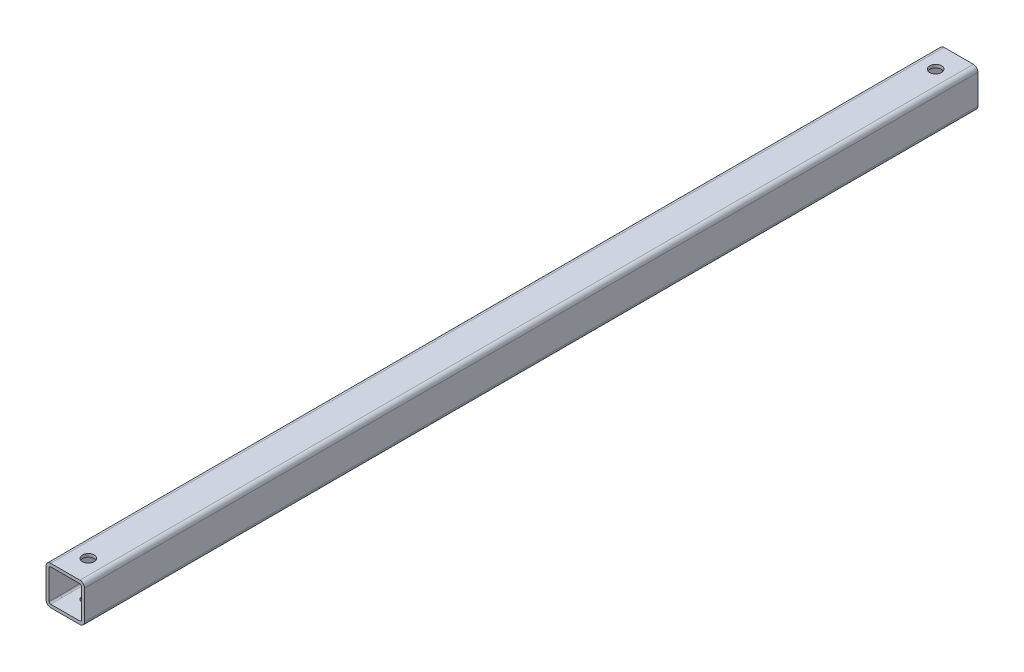
ISO-10303-21;
HEADER;
FILE_DESCRIPTION(('STEP AP214'),'2;1');
FILE_NAME('part.step','',(''),(''),'','','');
FILE_SCHEMA(('AUTOMOTIVE_DESIGN { 1 0 10303 214 1 1 1 1 }'));
ENDSEC;
DATA;
#1=APPLICATION_CONTEXT('core data for automotive mechanical design processes');
#2=APPLICATION_PROTOCOL_DEFINITION('international standard','automotive_design',2000,#1);
#3=PRODUCT_CONTEXT('',#1,'mechanical');
#4=PRODUCT('Part','Part','',(#3));
#5=PRODUCT_RELATED_PRODUCT_CATEGORY('part','',(#4));
#6=PRODUCT_DEFINITION_FORMATION('','',#4);
#7=PRODUCT_DEFINITION_CONTEXT('part definition',#1,'design');
#8=PRODUCT_DEFINITION('design','',#6,#7);
#9=PRODUCT_DEFINITION_SHAPE('','',#8);
#10=(LENGTH_UNIT() NAMED_UNIT(*) SI_UNIT(.MILLI.,.METRE.));
#11=(NAMED_UNIT(*) PLANE_ANGLE_UNIT() SI_UNIT($,.RADIAN.));
#12=(NAMED_UNIT(*) SI_UNIT($,.STERADIAN.) SOLID_ANGLE_UNIT());
#13=UNCERTAINTY_MEASURE_WITH_UNIT(LENGTH_MEASURE(1.E-05),#10,'distance_accuracy_value','');
#14=(GEOMETRIC_REPRESENTATION_CONTEXT(3) GLOBAL_UNCERTAINTY_ASSIGNED_CONTEXT((#13)) GLOBAL_UNIT_ASSIGNED_CONTEXT((#10,
#11,#12)) REPRESENTATION_CONTEXT('',''));
#15=CARTESIAN_POINT('',(0.,0.,0.));
#16=DIRECTION('',(0.,0.,1.));
#17=DIRECTION('',(1.,0.,0.));
#18=AXIS2_PLACEMENT_3D('',#15,#16,#17);
#19=CARTESIAN_POINT('',(2.27373675443232E-12,2.01794136955868E-11,579.999999970026));
#20=DIRECTION('',(0.,0.,1.));
#21=DIRECTION('',(1.,0.,0.));
#22=AXIS2_PLACEMENT_3D('',#19,#20,#21);
#23=PLANE('',#22);
#24=DIRECTION('',(0.,1.,0.));
#25=VECTOR('',#24,1.);
#26=CARTESIAN_POINT('',(-12.4999999999977,-4.74999999997983,579.999999970026));
#27=LINE('',#26,#25);
#28=CARTESIAN_POINT('',(-12.4999999999977,-9.49999999997981,579.999999970026));
#29=VERTEX_POINT('',#28);
#30=CARTESIAN_POINT('',(-12.4999999999977,9.50000000002017,579.999999970026));
#31=VERTEX_POINT('',#30);
#32=EDGE_CURVE('E159',#29,#31,#27,.T.);
#33=ORIENTED_EDGE('',*,*,#32,.F.);
#34=CARTESIAN_POINT('',(-9.49999999999768,-9.49999999997981,579.999999970026));
#35=DIRECTION('',(0.,0.,-1.));
#36=DIRECTION('',(1.,0.,0.));
#37=AXIS2_PLACEMENT_3D('',#34,#35,#36);
#38=CIRCLE('',#37,3.);
#39=CARTESIAN_POINT('',(-9.49999999999768,-12.4999999999798,579.999999970026));
#40=VERTEX_POINT('',#39);
#41=EDGE_CURVE('E274',#40,#29,#38,.T.);
#42=ORIENTED_EDGE('',*,*,#41,.F.);
#43=DIRECTION('',(-1.,0.,0.));
#44=VECTOR('',#43,1.);
#45=CARTESIAN_POINT('',(4.75000000000229,-12.4999999999798,579.999999970026));
#46=LINE('',#45,#44);
#47=CARTESIAN_POINT('',(9.5000000000023,-12.4999999999798,579.999999970026));
#48=VERTEX_POINT('',#47);
#49=EDGE_CURVE('E176',#48,#40,#46,.T.);
#50=ORIENTED_EDGE('',*,*,#49,.F.);
#51=CARTESIAN_POINT('',(9.5000000000023,-9.49999999997981,579.999999970026));
#52=DIRECTION('',(0.,0.,-1.));
#53=DIRECTION('',(0.,1.,0.));
#54=AXIS2_PLACEMENT_3D('',#51,#52,#53);
#55=CIRCLE('',#54,3.);
#56=CARTESIAN_POINT('',(12.5000000000023,-9.49999999997981,579.999999970026));
#57=VERTEX_POINT('',#56);
#58=EDGE_CURVE('E323',#57,#48,#55,.T.);
#59=ORIENTED_EDGE('',*,*,#58,.F.);
#60=DIRECTION('',(0.,-1.,0.));
#61=VECTOR('',#60,1.);
#62=CARTESIAN_POINT('',(12.5000000000023,4.75000000002019,579.999999970026));
#63=LINE('',#62,#61);
#64=CARTESIAN_POINT('',(12.5000000000023,9.50000000002017,579.999999970026));
#65=VERTEX_POINT('',#64);
#66=EDGE_CURVE('E209',#65,#57,#63,.T.);
#67=ORIENTED_EDGE('',*,*,#66,.F.);
#68=CARTESIAN_POINT('',(9.5000000000023,9.50000000002017,579.999999970026));
#69=DIRECTION('',(0.,0.,-1.));
#70=DIRECTION('',(-1.,0.,0.));
#71=AXIS2_PLACEMENT_3D('',#68,#69,#70);
#72=CIRCLE('',#71,3.);
#73=CARTESIAN_POINT('',(9.5000000000023,12.5000000000202,579.999999970026));
#74=VERTEX_POINT('',#73);
#75=EDGE_CURVE('E27',#74,#65,#72,.T.);
#76=ORIENTED_EDGE('',*,*,#75,.F.);
#77=DIRECTION('',(1.,0.,0.));
#78=VECTOR('',#77,1.);
#79=CARTESIAN_POINT('',(-4.74999999999774,12.5000000000202,579.999999970026));
#80=LINE('',#79,#78);
#81=CARTESIAN_POINT('',(-9.49999999999768,12.5000000000202,579.999999970026));
#82=VERTEX_POINT('',#81);
#83=EDGE_CURVE('E218',#82,#74,#80,.T.);
#84=ORIENTED_EDGE('',*,*,#83,.F.);
#85=CARTESIAN_POINT('',(-9.49999999999768,9.50000000002017,579.999999970026));
#86=DIRECTION('',(0.,0.,-1.));
#87=DIRECTION('',(0.,-1.,0.));
#88=AXIS2_PLACEMENT_3D('',#85,#86,#87);
#89=CIRCLE('',#88,3.);
#90=EDGE_CURVE('E241',#31,#82,#89,.T.);
#91=ORIENTED_EDGE('',*,*,#90,.F.);
#92=EDGE_LOOP('',(#33,#42,#50,#59,#67,#76,#84,#91));
#93=FACE_BOUND('',#92,.T.);
#94=DIRECTION('',(-1.,0.,0.));
#95=VECTOR('',#94,1.);
#96=CARTESIAN_POINT('',(-4.74999999999774,10.5000000000202,579.999999970026));
#97=LINE('',#96,#95);
#98=CARTESIAN_POINT('',(9.5000000000023,10.5000000000202,579.999999970026));
#99=VERTEX_POINT('',#98);
#100=CARTESIAN_POINT('',(-9.49999999999768,10.5000000000202,579.999999970026));
#101=VERTEX_POINT('',#100);
#102=EDGE_CURVE('E247',#99,#101,#97,.T.);
#103=ORIENTED_EDGE('',*,*,#102,.F.);
#104=CARTESIAN_POINT('',(9.5000000000023,9.50000000002017,579.999999970026));
#105=DIRECTION('',(0.,0.,1.));
#106=DIRECTION('',(-1.,0.,0.));
#107=AXIS2_PLACEMENT_3D('',#104,#105,#106);
#108=CIRCLE('',#107,1.);
#109=CARTESIAN_POINT('',(10.5000000000023,9.50000000002017,579.999999970026));
#110=VERTEX_POINT('',#109);
#111=EDGE_CURVE('E205',#110,#99,#108,.T.);
#112=ORIENTED_EDGE('',*,*,#111,.F.);
#113=DIRECTION('',(0.,1.,0.));
#114=VECTOR('',#113,1.);
#115=CARTESIAN_POINT('',(10.5000000000023,4.75000000002019,579.999999970026));
#116=LINE('',#115,#114);
#117=CARTESIAN_POINT('',(10.5000000000022,-9.49999999997981,579.999999970026));
#118=VERTEX_POINT('',#117);
#119=EDGE_CURVE('E164',#118,#110,#116,.T.);
#120=ORIENTED_EDGE('',*,*,#119,.F.);
#121=CARTESIAN_POINT('',(9.5000000000023,-9.49999999997981,579.999999970026));
#122=DIRECTION('',(0.,0.,1.));
#123=DIRECTION('',(0.,1.,0.));
#124=AXIS2_PLACEMENT_3D('',#121,#122,#123);
#125=CIRCLE('',#124,1.);
#126=CARTESIAN_POINT('',(9.5000000000023,-10.4999999999798,579.999999970026));
#127=VERTEX_POINT('',#126);
#128=EDGE_CURVE('E307',#127,#118,#125,.T.);
#129=ORIENTED_EDGE('',*,*,#128,.F.);
#130=DIRECTION('',(1.,0.,0.));
#131=VECTOR('',#130,1.);
#132=CARTESIAN_POINT('',(4.75000000000229,-10.4999999999798,579.999999970026));
#133=LINE('',#132,#131);
#134=CARTESIAN_POINT('',(-9.49999999999768,-10.4999999999798,579.999999970026));
#135=VERTEX_POINT('',#134);
#136=EDGE_CURVE('E175',#135,#127,#133,.T.);
#137=ORIENTED_EDGE('',*,*,#136,.F.);
#138=CARTESIAN_POINT('',(-9.49999999999768,-9.49999999997981,579.999999970026));
#139=DIRECTION('',(0.,0.,1.));
#140=DIRECTION('',(1.,0.,0.));
#141=AXIS2_PLACEMENT_3D('',#138,#139,#140);
#142=CIRCLE('',#141,1.);
#143=CARTESIAN_POINT('',(-10.4999999999977,-9.49999999997981,579.999999970026));
#144=VERTEX_POINT('',#143);
#145=EDGE_CURVE('E199',#144,#135,#142,.T.);
#146=ORIENTED_EDGE('',*,*,#145,.F.);
#147=DIRECTION('',(0.,-1.,0.));
#148=VECTOR('',#147,1.);
#149=CARTESIAN_POINT('',(-10.4999999999977,-4.7499999999798,579.999999970026));
#150=LINE('',#149,#148);
#151=CARTESIAN_POINT('',(-10.4999999999977,9.50000000002017,579.999999970026));
#152=VERTEX_POINT('',#151);
#153=EDGE_CURVE('E226',#152,#144,#150,.T.);
#154=ORIENTED_EDGE('',*,*,#153,.F.);
#155=CARTESIAN_POINT('',(-9.49999999999768,9.50000000002017,579.999999970026));
#156=DIRECTION('',(0.,0.,1.));
#157=DIRECTION('',(0.,-1.,0.));
#158=AXIS2_PLACEMENT_3D('',#155,#156,#157);
#159=CIRCLE('',#158,1.);
#160=EDGE_CURVE('E230',#101,#152,#159,.T.);
#161=ORIENTED_EDGE('',*,*,#160,.F.);
#162=EDGE_LOOP('',(#103,#112,#120,#129,#137,#146,#154,#161));
#163=FACE_BOUND('',#162,.T.);
#164=ADVANCED_FACE('F16',(#93,#163),#23,.T.);
#165=CARTESIAN_POINT('',(7.105427357601E-12,2.03215222427389E-11,2.61479726759717E-11));
#166=DIRECTION('',(0.,0.,1.));
#167=DIRECTION('',(1.,0.,0.));
#168=AXIS2_PLACEMENT_3D('',#165,#166,#167);
#169=PLANE('',#168);
#170=DIRECTION('',(0.,1.,0.));
#171=VECTOR('',#170,1.);
#172=CARTESIAN_POINT('',(-12.4999999999929,-4.74999999997969,2.55795384873636E-11));
#173=LINE('',#172,#171);
#174=CARTESIAN_POINT('',(-12.4999999999929,-9.49999999997967,2.55795384873636E-11));
#175=VERTEX_POINT('',#174);
#176=CARTESIAN_POINT('',(-12.4999999999929,9.50000000002031,2.55795384873636E-11));
#177=VERTEX_POINT('',#176);
#178=EDGE_CURVE('E348',#175,#177,#173,.T.);
#179=ORIENTED_EDGE('',*,*,#178,.T.);
#180=CARTESIAN_POINT('',(-9.49999999999292,9.50000000002031,2.55795384873636E-11));
#181=DIRECTION('',(0.,0.,-1.));
#182=DIRECTION('',(0.,-1.,0.));
#183=AXIS2_PLACEMENT_3D('',#180,#181,#182);
#184=CIRCLE('',#183,3.);
#185=CARTESIAN_POINT('',(-9.49999999999292,12.5000000000203,2.61479726759717E-11));
#186=VERTEX_POINT('',#185);
#187=EDGE_CURVE('E240',#177,#186,#184,.T.);
#188=ORIENTED_EDGE('',*,*,#187,.T.);
#189=DIRECTION('',(1.,0.,0.));
#190=VECTOR('',#189,1.);
#191=CARTESIAN_POINT('',(-4.74999999999291,12.5000000000203,2.61479726759717E-11));
#192=LINE('',#191,#190);
#193=CARTESIAN_POINT('',(9.50000000000713,12.5000000000203,2.61479726759717E-11));
#194=VERTEX_POINT('',#193);
#195=EDGE_CURVE('E217',#186,#194,#192,.T.);
#196=ORIENTED_EDGE('',*,*,#195,.T.);
#197=CARTESIAN_POINT('',(9.50000000000713,9.50000000002031,2.55795384873636E-11));
#198=DIRECTION('',(0.,0.,-1.));
#199=DIRECTION('',(-1.,0.,0.));
#200=AXIS2_PLACEMENT_3D('',#197,#198,#199);
#201=CIRCLE('',#200,3.);
#202=CARTESIAN_POINT('',(12.5000000000071,9.50000000002031,2.61479726759717E-11));
#203=VERTEX_POINT('',#202);
#204=EDGE_CURVE('E11',#194,#203,#201,.T.);
#205=ORIENTED_EDGE('',*,*,#204,.T.);
#206=DIRECTION('',(0.,-1.,0.));
#207=VECTOR('',#206,1.);
#208=CARTESIAN_POINT('',(12.5000000000071,4.75000000002034,2.61479726759717E-11));
#209=LINE('',#208,#207);
#210=CARTESIAN_POINT('',(12.5000000000071,-9.49999999997967,2.61479726759717E-11));
#211=VERTEX_POINT('',#210);
#212=EDGE_CURVE('E295',#203,#211,#209,.T.);
#213=ORIENTED_EDGE('',*,*,#212,.T.);
#214=CARTESIAN_POINT('',(9.50000000000713,-9.49999999997967,2.61479726759717E-11));
#215=DIRECTION('',(0.,0.,-1.));
#216=DIRECTION('',(0.,1.,0.));
#217=AXIS2_PLACEMENT_3D('',#214,#215,#216);
#218=CIRCLE('',#217,3.);
#219=CARTESIAN_POINT('',(9.50000000000713,-12.4999999999797,2.55795384873636E-11));
#220=VERTEX_POINT('',#219);
#221=EDGE_CURVE('E181',#211,#220,#218,.T.);
#222=ORIENTED_EDGE('',*,*,#221,.T.);
#223=DIRECTION('',(-1.,0.,0.));
#224=VECTOR('',#223,1.);
#225=CARTESIAN_POINT('',(4.75000000000712,-12.4999999999797,2.55795384873636E-11));
#226=LINE('',#225,#224);
#227=CARTESIAN_POINT('',(-9.49999999999292,-12.4999999999797,2.55795384873636E-11));
#228=VERTEX_POINT('',#227);
#229=EDGE_CURVE('E282',#220,#228,#226,.T.);
#230=ORIENTED_EDGE('',*,*,#229,.T.);
#231=CARTESIAN_POINT('',(-9.49999999999292,-9.49999999997967,2.61479726759717E-11));
#232=DIRECTION('',(0.,0.,-1.));
#233=DIRECTION('',(1.,0.,0.));
#234=AXIS2_PLACEMENT_3D('',#231,#232,#233);
#235=CIRCLE('',#234,3.);
#236=EDGE_CURVE('E244',#228,#175,#235,.T.);
#237=ORIENTED_EDGE('',*,*,#236,.T.);
#238=EDGE_LOOP('',(#179,#188,#196,#205,#213,#222,#230,#237));
#239=FACE_BOUND('',#238,.T.);
#240=DIRECTION('',(-1.,0.,0.));
#241=VECTOR('',#240,1.);
#242=CARTESIAN_POINT('',(-4.74999999999291,10.5000000000203,2.55795384873636E-11));
#243=LINE('',#242,#241);
#244=CARTESIAN_POINT('',(9.50000000000713,10.5000000000203,2.61479726759717E-11));
#245=VERTEX_POINT('',#244);
#246=CARTESIAN_POINT('',(-9.49999999999292,10.5000000000203,2.55795384873636E-11));
#247=VERTEX_POINT('',#246);
#248=EDGE_CURVE('E258',#245,#247,#243,.T.);
#249=ORIENTED_EDGE('',*,*,#248,.T.);
#250=CARTESIAN_POINT('',(-9.49999999999292,9.50000000002031,2.55795384873636E-11));
#251=DIRECTION('',(0.,0.,1.));
#252=DIRECTION('',(0.,-1.,0.));
#253=AXIS2_PLACEMENT_3D('',#250,#251,#252);
#254=CIRCLE('',#253,1.);
#255=CARTESIAN_POINT('',(-10.4999999999929,9.50000000002031,2.55795384873636E-11));
#256=VERTEX_POINT('',#255);
#257=EDGE_CURVE('E157',#247,#256,#254,.T.);
#258=ORIENTED_EDGE('',*,*,#257,.T.);
#259=DIRECTION('',(0.,-1.,0.));
#260=VECTOR('',#259,1.);
#261=CARTESIAN_POINT('',(-10.4999999999929,-4.74999999997969,2.55795384873636E-11));
#262=LINE('',#261,#260);
#263=CARTESIAN_POINT('',(-10.4999999999929,-9.49999999997967,2.61479726759717E-11));
#264=VERTEX_POINT('',#263);
#265=EDGE_CURVE('E222',#256,#264,#262,.T.);
#266=ORIENTED_EDGE('',*,*,#265,.T.);
#267=CARTESIAN_POINT('',(-9.49999999999292,-9.49999999997967,2.61479726759717E-11));
#268=DIRECTION('',(0.,0.,1.));
#269=DIRECTION('',(1.,0.,0.));
#270=AXIS2_PLACEMENT_3D('',#267,#268,#269);
#271=CIRCLE('',#270,1.);
#272=CARTESIAN_POINT('',(-9.49999999999292,-10.4999999999797,2.55795384873636E-11));
#273=VERTEX_POINT('',#272);
#274=EDGE_CURVE('E195',#264,#273,#271,.T.);
#275=ORIENTED_EDGE('',*,*,#274,.T.);
#276=DIRECTION('',(1.,0.,0.));
#277=VECTOR('',#276,1.);
#278=CARTESIAN_POINT('',(4.75000000000712,-10.4999999999797,2.61479726759717E-11));
#279=LINE('',#278,#277);
#280=CARTESIAN_POINT('',(9.50000000000713,-10.4999999999797,2.61479726759717E-11));
#281=VERTEX_POINT('',#280);
#282=EDGE_CURVE('E174',#273,#281,#279,.T.);
#283=ORIENTED_EDGE('',*,*,#282,.T.);
#284=CARTESIAN_POINT('',(9.50000000000713,-9.49999999997967,2.61479726759717E-11));
#285=DIRECTION('',(0.,0.,1.));
#286=DIRECTION('',(0.,1.,0.));
#287=AXIS2_PLACEMENT_3D('',#284,#285,#286);
#288=CIRCLE('',#287,1.);
#289=CARTESIAN_POINT('',(10.5000000000071,-9.49999999997967,2.61479726759717E-11));
#290=VERTEX_POINT('',#289);
#291=EDGE_CURVE('E169',#281,#290,#288,.T.);
#292=ORIENTED_EDGE('',*,*,#291,.T.);
#293=DIRECTION('',(0.,1.,0.));
#294=VECTOR('',#293,1.);
#295=CARTESIAN_POINT('',(10.5000000000071,4.75000000002034,2.61479726759717E-11));
#296=LINE('',#295,#294);
#297=CARTESIAN_POINT('',(10.5000000000071,9.50000000002031,2.55795384873636E-11));
#298=VERTEX_POINT('',#297);
#299=EDGE_CURVE('E193',#290,#298,#296,.T.);
#300=ORIENTED_EDGE('',*,*,#299,.T.);
#301=CARTESIAN_POINT('',(9.50000000000713,9.50000000002031,2.55795384873636E-11));
#302=DIRECTION('',(0.,0.,1.));
#303=DIRECTION('',(-1.,0.,0.));
#304=AXIS2_PLACEMENT_3D('',#301,#302,#303);
#305=CIRCLE('',#304,1.);
#306=EDGE_CURVE('E204',#298,#245,#305,.T.);
#307=ORIENTED_EDGE('',*,*,#306,.T.);
#308=EDGE_LOOP('',(#249,#258,#266,#275,#283,#292,#300,#307));
#309=FACE_BOUND('',#308,.T.);
#310=ADVANCED_FACE('F446',(#239,#309),#169,.F.);
#311=CARTESIAN_POINT('',(9.50000000000713,9.50000000002031,2.55795384873636E-11));
#312=DIRECTION('',(0.,0.,1.));
#313=DIRECTION('',(-1.,0.,0.));
#314=AXIS2_PLACEMENT_3D('',#311,#312,#313);
#315=CYLINDRICAL_SURFACE('',#314,3.);
#316=ORIENTED_EDGE('',*,*,#75,.T.);
#317=DIRECTION('',(0.,0.,1.));
#318=VECTOR('',#317,1.);
#319=CARTESIAN_POINT('',(12.5000000000071,9.50000000002031,2.61479726759717E-11));
#320=LINE('',#319,#318);
#321=EDGE_CURVE('E299',#203,#65,#320,.T.);
#322=ORIENTED_EDGE('',*,*,#321,.F.);
#323=ORIENTED_EDGE('',*,*,#204,.F.);
#324=DIRECTION('',(0.,0.,1.));
#325=VECTOR('',#324,1.);
#326=CARTESIAN_POINT('',(9.50000000000713,12.5000000000203,2.61479726759717E-11));
#327=LINE('',#326,#325);
#328=EDGE_CURVE('E214',#194,#74,#327,.T.);
#329=ORIENTED_EDGE('',*,*,#328,.T.);
#330=EDGE_LOOP('',(#316,#322,#323,#329));
#331=FACE_BOUND('',#330,.T.);
#332=ADVANCED_FACE('F788',(#331),#315,.T.);
#333=CARTESIAN_POINT('',(-9.49999999999292,12.5000000000203,2.61479726759717E-11));
#334=DIRECTION('',(0.,1.,0.));
#335=DIRECTION('',(1.,0.,0.));
#336=AXIS2_PLACEMENT_3D('',#333,#334,#335);
#337=PLANE('',#336);
#338=ORIENTED_EDGE('',*,*,#83,.T.);
#339=ORIENTED_EDGE('',*,*,#328,.F.);
#340=ORIENTED_EDGE('',*,*,#195,.F.);
#341=DIRECTION('',(0.,0.,1.));
#342=VECTOR('',#341,1.);
#343=CARTESIAN_POINT('',(-9.49999999999292,12.5000000000203,2.61479726759717E-11));
#344=LINE('',#343,#342);
#345=EDGE_CURVE('E236',#186,#82,#344,.T.);
#346=ORIENTED_EDGE('',*,*,#345,.T.);
#347=EDGE_LOOP('',(#338,#339,#340,#346));
#348=FACE_BOUND('',#347,.T.);
#349=CARTESIAN_POINT('',(7.105427357601E-12,12.5000000000202,15.0000000000261));
#350=DIRECTION('',(0.,-1.,0.));
#351=DIRECTION('',(0.,0.,-1.));
#352=AXIS2_PLACEMENT_3D('',#349,#350,#351);
#353=CIRCLE('',#352,3.8235);
#354=CARTESIAN_POINT('',(7.105427357601E-12,12.5000000000203,11.1765000000261));
#355=VERTEX_POINT('',#354);
#356=EDGE_CURVE('E210',#355,#355,#353,.T.);
#357=ORIENTED_EDGE('',*,*,#356,.T.);
#358=EDGE_LOOP('',(#357));
#359=FACE_BOUND('',#358,.T.);
#360=CARTESIAN_POINT('',(2.48689957516035E-12,12.5000000000203,564.99999996906));
#361=DIRECTION('',(0.,-1.,0.));
#362=DIRECTION('',(0.,0.,-1.));
#363=AXIS2_PLACEMENT_3D('',#360,#361,#362);
#364=CIRCLE('',#363,3.8235);
#365=CARTESIAN_POINT('',(2.48689957516035E-12,12.5000000000203,561.17649996906));
#366=VERTEX_POINT('',#365);
#367=EDGE_CURVE('E142',#366,#366,#364,.T.);
#368=ORIENTED_EDGE('',*,*,#367,.T.);
#369=EDGE_LOOP('',(#368));
#370=FACE_BOUND('',#369,.T.);
#371=ADVANCED_FACE('F779',(#348,#359,#370),#337,.T.);
#372=CARTESIAN_POINT('',(-9.49999999999292,9.50000000002031,2.55795384873636E-11));
#373=DIRECTION('',(0.,0.,1.));
#374=DIRECTION('',(0.,-1.,0.));
#375=AXIS2_PLACEMENT_3D('',#372,#373,#374);
#376=CYLINDRICAL_SURFACE('',#375,3.);
#377=ORIENTED_EDGE('',*,*,#90,.T.);
#378=ORIENTED_EDGE('',*,*,#345,.F.);
#379=ORIENTED_EDGE('',*,*,#187,.F.);
#380=DIRECTION('',(0.,0.,1.));
#381=VECTOR('',#380,1.);
#382=CARTESIAN_POINT('',(-12.4999999999929,9.50000000002031,2.55795384873636E-11));
#383=LINE('',#382,#381);
#384=EDGE_CURVE('E163',#177,#31,#383,.T.);
#385=ORIENTED_EDGE('',*,*,#384,.T.);
#386=EDGE_LOOP('',(#377,#378,#379,#385));
#387=FACE_BOUND('',#386,.T.);
#388=ADVANCED_FACE('F368',(#387),#376,.T.);
#389=CARTESIAN_POINT('',(-12.4999999999929,-9.49999999997967,2.55795384873636E-11));
#390=DIRECTION('',(-1.,0.,0.));
#391=DIRECTION('',(0.,0.,1.));
#392=AXIS2_PLACEMENT_3D('',#389,#390,#391);
#393=PLANE('',#392);
#394=ORIENTED_EDGE('',*,*,#32,.T.);
#395=ORIENTED_EDGE('',*,*,#384,.F.);
#396=ORIENTED_EDGE('',*,*,#178,.F.);
#397=DIRECTION('',(0.,0.,1.));
#398=VECTOR('',#397,1.);
#399=CARTESIAN_POINT('',(-12.4999999999929,-9.49999999997967,2.55795384873636E-11));
#400=LINE('',#399,#398);
#401=EDGE_CURVE('E248',#175,#29,#400,.T.);
#402=ORIENTED_EDGE('',*,*,#401,.T.);
#403=EDGE_LOOP('',(#394,#395,#396,#402));
#404=FACE_BOUND('',#403,.T.);
#405=ADVANCED_FACE('F18',(#404),#393,.T.);
#406=CARTESIAN_POINT('',(-9.49999999999292,9.50000000002031,2.55795384873636E-11));
#407=DIRECTION('',(0.,0.,1.));
#408=DIRECTION('',(0.,-1.,0.));
#409=AXIS2_PLACEMENT_3D('',#406,#407,#408);
#410=CYLINDRICAL_SURFACE('',#409,1.);
#411=ORIENTED_EDGE('',*,*,#160,.T.);
#412=DIRECTION('',(0.,0.,1.));
#413=VECTOR('',#412,1.);
#414=CARTESIAN_POINT('',(-10.4999999999929,9.50000000002031,2.55795384873636E-11));
#415=LINE('',#414,#413);
#416=EDGE_CURVE('E225',#256,#152,#415,.T.);
#417=ORIENTED_EDGE('',*,*,#416,.F.);
#418=ORIENTED_EDGE('',*,*,#257,.F.);
#419=DIRECTION('',(0.,0.,1.));
#420=VECTOR('',#419,1.);
#421=CARTESIAN_POINT('',(-9.49999999999292,10.5000000000203,2.55795384873636E-11));
#422=LINE('',#421,#420);
#423=EDGE_CURVE('E251',#247,#101,#422,.T.);
#424=ORIENTED_EDGE('',*,*,#423,.T.);
#425=EDGE_LOOP('',(#411,#417,#418,#424));
#426=FACE_BOUND('',#425,.T.);
#427=ADVANCED_FACE('F439',(#426),#410,.F.);
#428=CARTESIAN_POINT('',(-10.4999999999929,-9.49999999997967,2.61479726759717E-11));
#429=DIRECTION('',(-1.,0.,0.));
#430=DIRECTION('',(0.,0.,1.));
#431=AXIS2_PLACEMENT_3D('',#428,#429,#430);
#432=PLANE('',#431);
#433=ORIENTED_EDGE('',*,*,#153,.T.);
#434=DIRECTION('',(0.,0.,1.));
#435=VECTOR('',#434,1.);
#436=CARTESIAN_POINT('',(-10.4999999999929,-9.49999999997967,2.61479726759717E-11));
#437=LINE('',#436,#435);
#438=EDGE_CURVE('E198',#264,#144,#437,.T.);
#439=ORIENTED_EDGE('',*,*,#438,.F.);
#440=ORIENTED_EDGE('',*,*,#265,.F.);
#441=ORIENTED_EDGE('',*,*,#416,.T.);
#442=EDGE_LOOP('',(#433,#439,#440,#441));
#443=FACE_BOUND('',#442,.T.);
#444=ADVANCED_FACE('F442',(#443),#432,.F.);
#445=CARTESIAN_POINT('',(-9.49999999999292,-9.49999999997967,2.61479726759717E-11));
#446=DIRECTION('',(0.,0.,1.));
#447=DIRECTION('',(1.,0.,0.));
#448=AXIS2_PLACEMENT_3D('',#445,#446,#447);
#449=CYLINDRICAL_SURFACE('',#448,1.);
#450=ORIENTED_EDGE('',*,*,#145,.T.);
#451=DIRECTION('',(0.,0.,1.));
#452=VECTOR('',#451,1.);
#453=CARTESIAN_POINT('',(-9.49999999999292,-10.4999999999797,2.55795384873636E-11));
#454=LINE('',#453,#452);
#455=EDGE_CURVE('E335',#273,#135,#454,.T.);
#456=ORIENTED_EDGE('',*,*,#455,.F.);
#457=ORIENTED_EDGE('',*,*,#274,.F.);
#458=ORIENTED_EDGE('',*,*,#438,.T.);
#459=EDGE_LOOP('',(#450,#456,#457,#458));
#460=FACE_BOUND('',#459,.T.);
#461=ADVANCED_FACE('F738',(#460),#449,.F.);
#462=CARTESIAN_POINT('',(-9.49999999999292,10.5000000000203,2.55795384873636E-11));
#463=DIRECTION('',(0.,1.,0.));
#464=DIRECTION('',(1.,0.,0.));
#465=AXIS2_PLACEMENT_3D('',#462,#463,#464);
#466=PLANE('',#465);
#467=ORIENTED_EDGE('',*,*,#102,.T.);
#468=ORIENTED_EDGE('',*,*,#423,.F.);
#469=ORIENTED_EDGE('',*,*,#248,.F.);
#470=DIRECTION('',(0.,0.,1.));
#471=VECTOR('',#470,1.);
#472=CARTESIAN_POINT('',(9.50000000000713,10.5000000000203,2.61479726759717E-11));
#473=LINE('',#472,#471);
#474=EDGE_CURVE('E200',#245,#99,#473,.T.);
#475=ORIENTED_EDGE('',*,*,#474,.T.);
#476=EDGE_LOOP('',(#467,#468,#469,#475));
#477=FACE_BOUND('',#476,.T.);
#478=CARTESIAN_POINT('',(7.105427357601E-12,10.5000000000202,15.0000000000257));
#479=DIRECTION('',(0.,1.,0.));
#480=DIRECTION('',(0.,0.,-1.));
#481=AXIS2_PLACEMENT_3D('',#478,#479,#480);
#482=CIRCLE('',#481,3.8235);
#483=CARTESIAN_POINT('',(6.89226453687297E-12,10.5000000000202,18.8235000000257));
#484=VERTEX_POINT('',#483);
#485=EDGE_CURVE('E187',#484,#484,#482,.T.);
#486=ORIENTED_EDGE('',*,*,#485,.T.);
#487=EDGE_LOOP('',(#486));
#488=FACE_BOUND('',#487,.T.);
#489=CARTESIAN_POINT('',(2.48689957516035E-12,10.5000000000203,564.99999996906));
#490=DIRECTION('',(0.,1.,0.));
#491=DIRECTION('',(0.,0.,-1.));
#492=AXIS2_PLACEMENT_3D('',#489,#490,#491);
#493=CIRCLE('',#492,3.8235);
#494=CARTESIAN_POINT('',(2.34479102800833E-12,10.5000000000203,568.82349996906));
#495=VERTEX_POINT('',#494);
#496=EDGE_CURVE('E20',#495,#495,#493,.T.);
#497=ORIENTED_EDGE('',*,*,#496,.T.);
#498=EDGE_LOOP('',(#497));
#499=FACE_BOUND('',#498,.T.);
#500=ADVANCED_FACE('F138',(#477,#488,#499),#466,.F.);
#501=CARTESIAN_POINT('',(-9.49999999999292,-9.49999999997967,2.61479726759717E-11));
#502=DIRECTION('',(0.,0.,1.));
#503=DIRECTION('',(1.,0.,0.));
#504=AXIS2_PLACEMENT_3D('',#501,#502,#503);
#505=CYLINDRICAL_SURFACE('',#504,3.);
#506=ORIENTED_EDGE('',*,*,#41,.T.);
#507=ORIENTED_EDGE('',*,*,#401,.F.);
#508=ORIENTED_EDGE('',*,*,#236,.F.);
#509=DIRECTION('',(0.,0.,1.));
#510=VECTOR('',#509,1.);
#511=CARTESIAN_POINT('',(-9.49999999999292,-12.4999999999797,2.55795384873636E-11));
#512=LINE('',#511,#510);
#513=EDGE_CURVE('E180',#228,#40,#512,.T.);
#514=ORIENTED_EDGE('',*,*,#513,.T.);
#515=EDGE_LOOP('',(#506,#507,#508,#514));
#516=FACE_BOUND('',#515,.T.);
#517=ADVANCED_FACE('F717',(#516),#505,.T.);
#518=CARTESIAN_POINT('',(9.50000000000713,-12.4999999999797,2.55795384873636E-11));
#519=DIRECTION('',(0.,-1.,0.));
#520=DIRECTION('',(0.,0.,-1.));
#521=AXIS2_PLACEMENT_3D('',#518,#519,#520);
#522=PLANE('',#521);
#523=ORIENTED_EDGE('',*,*,#49,.T.);
#524=ORIENTED_EDGE('',*,*,#513,.F.);
#525=ORIENTED_EDGE('',*,*,#229,.F.);
#526=DIRECTION('',(0.,0.,1.));
#527=VECTOR('',#526,1.);
#528=CARTESIAN_POINT('',(9.50000000000713,-12.4999999999797,2.55795384873636E-11));
#529=LINE('',#528,#527);
#530=EDGE_CURVE('E319',#220,#48,#529,.T.);
#531=ORIENTED_EDGE('',*,*,#530,.T.);
#532=EDGE_LOOP('',(#523,#524,#525,#531));
#533=FACE_BOUND('',#532,.T.);
#534=CARTESIAN_POINT('',(7.105427357601E-12,-12.4999999999798,15.0000000000256));
#535=DIRECTION('',(0.,1.,0.));
#536=DIRECTION('',(0.,0.,-1.));
#537=AXIS2_PLACEMENT_3D('',#534,#535,#536);
#538=CIRCLE('',#537,3.8235);
#539=CARTESIAN_POINT('',(6.89226453687297E-12,-12.4999999999798,18.8235000000256));
#540=VERTEX_POINT('',#539);
#541=EDGE_CURVE('E186',#540,#540,#538,.T.);
#542=ORIENTED_EDGE('',*,*,#541,.T.);
#543=EDGE_LOOP('',(#542));
#544=FACE_BOUND('',#543,.T.);
#545=CARTESIAN_POINT('',(2.48689957516035E-12,-12.4999999999797,564.99999996906));
#546=DIRECTION('',(0.,1.,0.));
#547=DIRECTION('',(0.,0.,-1.));
#548=AXIS2_PLACEMENT_3D('',#545,#546,#547);
#549=CIRCLE('',#548,3.8235);
#550=CARTESIAN_POINT('',(2.34479102800833E-12,-12.4999999999798,568.82349996906));
#551=VERTEX_POINT('',#550);
#552=EDGE_CURVE('E148',#551,#551,#549,.T.);
#553=ORIENTED_EDGE('',*,*,#552,.T.);
#554=EDGE_LOOP('',(#553));
#555=FACE_BOUND('',#554,.T.);
#556=ADVANCED_FACE('F705',(#533,#544,#555),#522,.T.);
#557=CARTESIAN_POINT('',(9.50000000000713,-9.49999999997967,2.61479726759717E-11));
#558=DIRECTION('',(0.,0.,1.));
#559=DIRECTION('',(0.,1.,0.));
#560=AXIS2_PLACEMENT_3D('',#557,#558,#559);
#561=CYLINDRICAL_SURFACE('',#560,3.);
#562=ORIENTED_EDGE('',*,*,#58,.T.);
#563=ORIENTED_EDGE('',*,*,#530,.F.);
#564=ORIENTED_EDGE('',*,*,#221,.F.);
#565=DIRECTION('',(0.,0.,1.));
#566=VECTOR('',#565,1.);
#567=CARTESIAN_POINT('',(12.5000000000071,-9.49999999997967,2.61479726759717E-11));
#568=LINE('',#567,#566);
#569=EDGE_CURVE('E300',#211,#57,#568,.T.);
#570=ORIENTED_EDGE('',*,*,#569,.T.);
#571=EDGE_LOOP('',(#562,#563,#564,#570));
#572=FACE_BOUND('',#571,.T.);
#573=ADVANCED_FACE('F694',(#572),#561,.T.);
#574=CARTESIAN_POINT('',(12.5000000000071,9.50000000002031,2.61479726759717E-11));
#575=DIRECTION('',(1.,0.,0.));
#576=DIRECTION('',(0.,0.,1.));
#577=AXIS2_PLACEMENT_3D('',#574,#575,#576);
#578=PLANE('',#577);
#579=ORIENTED_EDGE('',*,*,#66,.T.);
#580=ORIENTED_EDGE('',*,*,#569,.F.);
#581=ORIENTED_EDGE('',*,*,#212,.F.);
#582=ORIENTED_EDGE('',*,*,#321,.T.);
#583=EDGE_LOOP('',(#579,#580,#581,#582));
#584=FACE_BOUND('',#583,.T.);
#585=ADVANCED_FACE('F683',(#584),#578,.T.);
#586=CARTESIAN_POINT('',(9.50000000000713,9.50000000002031,2.55795384873636E-11));
#587=DIRECTION('',(0.,0.,1.));
#588=DIRECTION('',(-1.,0.,0.));
#589=AXIS2_PLACEMENT_3D('',#586,#587,#588);
#590=CYLINDRICAL_SURFACE('',#589,1.);
#591=ORIENTED_EDGE('',*,*,#111,.T.);
#592=ORIENTED_EDGE('',*,*,#474,.F.);
#593=ORIENTED_EDGE('',*,*,#306,.F.);
#594=DIRECTION('',(0.,0.,1.));
#595=VECTOR('',#594,1.);
#596=CARTESIAN_POINT('',(10.5000000000071,9.50000000002031,2.55795384873636E-11));
#597=LINE('',#596,#595);
#598=EDGE_CURVE('E168',#298,#110,#597,.T.);
#599=ORIENTED_EDGE('',*,*,#598,.T.);
#600=EDGE_LOOP('',(#591,#592,#593,#599));
#601=FACE_BOUND('',#600,.T.);
#602=ADVANCED_FACE('F672',(#601),#590,.F.);
#603=CARTESIAN_POINT('',(10.5000000000071,9.50000000002031,2.55795384873636E-11));
#604=DIRECTION('',(1.,0.,0.));
#605=DIRECTION('',(0.,0.,1.));
#606=AXIS2_PLACEMENT_3D('',#603,#604,#605);
#607=PLANE('',#606);
#608=ORIENTED_EDGE('',*,*,#119,.T.);
#609=ORIENTED_EDGE('',*,*,#598,.F.);
#610=ORIENTED_EDGE('',*,*,#299,.F.);
#611=DIRECTION('',(0.,0.,1.));
#612=VECTOR('',#611,1.);
#613=CARTESIAN_POINT('',(10.5000000000071,-9.49999999997967,2.61479726759717E-11));
#614=LINE('',#613,#612);
#615=EDGE_CURVE('E303',#290,#118,#614,.T.);
#616=ORIENTED_EDGE('',*,*,#615,.T.);
#617=EDGE_LOOP('',(#608,#609,#610,#616));
#618=FACE_BOUND('',#617,.T.);
#619=ADVANCED_FACE('F661',(#618),#607,.F.);
#620=CARTESIAN_POINT('',(9.50000000000713,-9.49999999997967,2.61479726759717E-11));
#621=DIRECTION('',(0.,0.,1.));
#622=DIRECTION('',(0.,1.,0.));
#623=AXIS2_PLACEMENT_3D('',#620,#621,#622);
#624=CYLINDRICAL_SURFACE('',#623,1.);
#625=ORIENTED_EDGE('',*,*,#128,.T.);
#626=ORIENTED_EDGE('',*,*,#615,.F.);
#627=ORIENTED_EDGE('',*,*,#291,.F.);
#628=DIRECTION('',(0.,0.,1.));
#629=VECTOR('',#628,1.);
#630=CARTESIAN_POINT('',(9.50000000000713,-10.4999999999797,2.61479726759717E-11));
#631=LINE('',#630,#629);
#632=EDGE_CURVE('E170',#281,#127,#631,.T.);
#633=ORIENTED_EDGE('',*,*,#632,.T.);
#634=EDGE_LOOP('',(#625,#626,#627,#633));
#635=FACE_BOUND('',#634,.T.);
#636=ADVANCED_FACE('F649',(#635),#624,.F.);
#637=CARTESIAN_POINT('',(9.50000000000713,-10.4999999999797,2.61479726759717E-11));
#638=DIRECTION('',(0.,-1.,0.));
#639=DIRECTION('',(0.,0.,-1.));
#640=AXIS2_PLACEMENT_3D('',#637,#638,#639);
#641=PLANE('',#640);
#642=ORIENTED_EDGE('',*,*,#136,.T.);
#643=ORIENTED_EDGE('',*,*,#632,.F.);
#644=ORIENTED_EDGE('',*,*,#282,.F.);
#645=ORIENTED_EDGE('',*,*,#455,.T.);
#646=EDGE_LOOP('',(#642,#643,#644,#645));
#647=FACE_BOUND('',#646,.T.);
#648=CARTESIAN_POINT('',(7.105427357601E-12,-10.4999999999798,15.0000000000261));
#649=DIRECTION('',(0.,-1.,0.));
#650=DIRECTION('',(0.,0.,-1.));
#651=AXIS2_PLACEMENT_3D('',#648,#649,#650);
#652=CIRCLE('',#651,3.8235);
#653=CARTESIAN_POINT('',(6.89226453687297E-12,-10.4999999999798,18.8235000000262));
#654=VERTEX_POINT('',#653);
#655=EDGE_CURVE('E182',#654,#654,#652,.T.);
#656=ORIENTED_EDGE('',*,*,#655,.T.);
#657=EDGE_LOOP('',(#656));
#658=FACE_BOUND('',#657,.T.);
#659=CARTESIAN_POINT('',(2.48689957516035E-12,-10.4999999999797,564.99999996906));
#660=DIRECTION('',(0.,-1.,0.));
#661=DIRECTION('',(0.,0.,-1.));
#662=AXIS2_PLACEMENT_3D('',#659,#660,#661);
#663=CIRCLE('',#662,3.8235);
#664=CARTESIAN_POINT('',(2.34479102800833E-12,-10.4999999999798,568.82349996906));
#665=VERTEX_POINT('',#664);
#666=EDGE_CURVE('E141',#665,#665,#663,.T.);
#667=ORIENTED_EDGE('',*,*,#666,.T.);
#668=EDGE_LOOP('',(#667));
#669=FACE_BOUND('',#668,.T.);
#670=ADVANCED_FACE('F637',(#647,#658,#669),#641,.F.);
#671=CARTESIAN_POINT('',(7.105427357601E-12,-7.49999999997982,15.0000000000261));
#672=DIRECTION('',(0.,1.,0.));
#673=DIRECTION('',(0.,0.,-1.));
#674=AXIS2_PLACEMENT_3D('',#671,#672,#673);
#675=CYLINDRICAL_SURFACE('',#674,3.8235);
#676=ORIENTED_EDGE('',*,*,#541,.F.);
#677=EDGE_LOOP('',(#676));
#678=FACE_BOUND('',#677,.T.);
#679=ORIENTED_EDGE('',*,*,#655,.F.);
#680=EDGE_LOOP('',(#679));
#681=FACE_BOUND('',#680,.T.);
#682=ADVANCED_FACE('F626',(#678,#681),#675,.F.);
#683=CARTESIAN_POINT('',(7.105427357601E-12,-7.49999999997982,15.0000000000261));
#684=DIRECTION('',(0.,1.,0.));
#685=DIRECTION('',(0.,0.,-1.));
#686=AXIS2_PLACEMENT_3D('',#683,#684,#685);
#687=CYLINDRICAL_SURFACE('',#686,3.8235);
#688=ORIENTED_EDGE('',*,*,#485,.F.);
#689=EDGE_LOOP('',(#688));
#690=FACE_BOUND('',#689,.T.);
#691=ORIENTED_EDGE('',*,*,#356,.F.);
#692=EDGE_LOOP('',(#691));
#693=FACE_BOUND('',#692,.T.);
#694=ADVANCED_FACE('F615',(#690,#693),#687,.F.);
#695=CARTESIAN_POINT('',(2.48689957516035E-12,-7.49999999997968,564.99999996906));
#696=DIRECTION('',(0.,1.,0.));
#697=DIRECTION('',(0.,0.,-1.));
#698=AXIS2_PLACEMENT_3D('',#695,#696,#697);
#699=CYLINDRICAL_SURFACE('',#698,3.8235);
#700=ORIENTED_EDGE('',*,*,#552,.F.);
#701=EDGE_LOOP('',(#700));
#702=FACE_BOUND('',#701,.T.);
#703=ORIENTED_EDGE('',*,*,#666,.F.);
#704=EDGE_LOOP('',(#703));
#705=FACE_BOUND('',#704,.T.);
#706=ADVANCED_FACE('F602',(#702,#705),#699,.F.);
#707=CARTESIAN_POINT('',(2.48689957516035E-12,-7.49999999997968,564.99999996906));
#708=DIRECTION('',(0.,1.,0.));
#709=DIRECTION('',(0.,0.,-1.));
#710=AXIS2_PLACEMENT_3D('',#707,#708,#709);
#711=CYLINDRICAL_SURFACE('',#710,3.8235);
#712=ORIENTED_EDGE('',*,*,#496,.F.);
#713=EDGE_LOOP('',(#712));
#714=FACE_BOUND('',#713,.T.);
#715=ORIENTED_EDGE('',*,*,#367,.F.);
#716=EDGE_LOOP('',(#715));
#717=FACE_BOUND('',#716,.T.);
#718=ADVANCED_FACE('F577',(#714,#717),#711,.F.);
#719=CLOSED_SHELL('',(#164,#310,#332,#371,#388,#405,#427,#444,#461,#500,#517,#556,#573,#585,
#602,#619,#636,#670,#682,#694,#706,#718));
#720=MANIFOLD_SOLID_BREP('B1',#719);
#721=ADVANCED_BREP_SHAPE_REPRESENTATION('',(#18,#720),#14);
#722=SHAPE_DEFINITION_REPRESENTATION(#9,#721);
ENDSEC;
END-ISO-10303-21;
